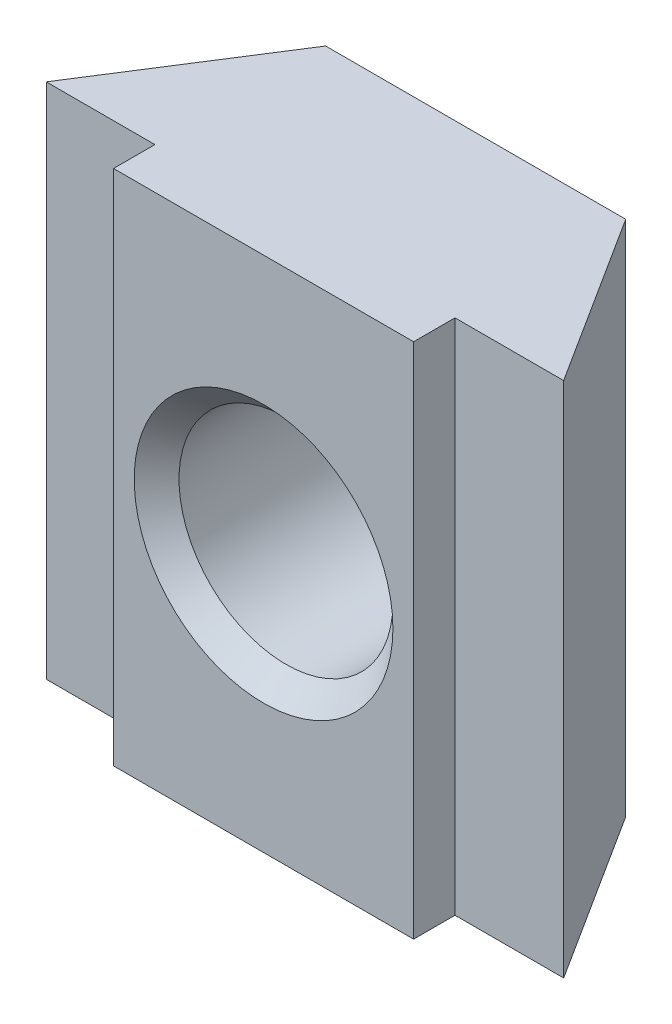
ISO-10303-21;
HEADER;
FILE_DESCRIPTION(('STEP AP214'),'2;1');
FILE_NAME('part.step','',(''),(''),'','','');
FILE_SCHEMA(('AUTOMOTIVE_DESIGN { 1 0 10303 214 1 1 1 1 }'));
ENDSEC;
DATA;
#1=APPLICATION_CONTEXT('core data for automotive mechanical design processes');
#2=APPLICATION_PROTOCOL_DEFINITION('international standard','automotive_design',2000,#1);
#3=PRODUCT_CONTEXT('',#1,'mechanical');
#4=PRODUCT('Part','Part','',(#3));
#5=PRODUCT_RELATED_PRODUCT_CATEGORY('part','',(#4));
#6=PRODUCT_DEFINITION_FORMATION('','',#4);
#7=PRODUCT_DEFINITION_CONTEXT('part definition',#1,'design');
#8=PRODUCT_DEFINITION('design','',#6,#7);
#9=PRODUCT_DEFINITION_SHAPE('','',#8);
#10=(LENGTH_UNIT() NAMED_UNIT(*) SI_UNIT(.MILLI.,.METRE.));
#11=(NAMED_UNIT(*) PLANE_ANGLE_UNIT() SI_UNIT($,.RADIAN.));
#12=(NAMED_UNIT(*) SI_UNIT($,.STERADIAN.) SOLID_ANGLE_UNIT());
#13=UNCERTAINTY_MEASURE_WITH_UNIT(LENGTH_MEASURE(1.E-05),#10,'distance_accuracy_value','');
#14=(GEOMETRIC_REPRESENTATION_CONTEXT(3) GLOBAL_UNCERTAINTY_ASSIGNED_CONTEXT((#13)) GLOBAL_UNIT_ASSIGNED_CONTEXT((#10,
#11,#12)) REPRESENTATION_CONTEXT('',''));
#15=CARTESIAN_POINT('',(0.,0.,0.));
#16=DIRECTION('',(0.,0.,1.));
#17=DIRECTION('',(1.,0.,0.));
#18=AXIS2_PLACEMENT_3D('',#15,#16,#17);
#19=CARTESIAN_POINT('',(13.,21.5,-9.30000000010978));
#20=DIRECTION('',(0.,0.,1.));
#21=DIRECTION('',(1.,0.,0.));
#22=AXIS2_PLACEMENT_3D('',#19,#20,#21);
#23=CONICAL_SURFACE('',#22,2.49999999990723,0.785398163397448);
#24=CARTESIAN_POINT('',(13.,21.5,-9.29999999999609));
#25=DIRECTION('',(0.,0.,1.));
#26=DIRECTION('',(1.,0.,0.));
#27=AXIS2_PLACEMENT_3D('',#24,#25,#26);
#28=CIRCLE('',#27,2.50000000002092);
#29=CARTESIAN_POINT('',(15.5000000000209,21.5,-9.29999999999609));
#30=VERTEX_POINT('',#29);
#31=EDGE_CURVE('E20',#30,#30,#28,.F.);
#32=ORIENTED_EDGE('',*,*,#31,.F.);
#33=EDGE_LOOP('',(#32));
#34=FACE_BOUND('',#33,.T.);
#35=CARTESIAN_POINT('',(13.,21.5,-9.733));
#36=DIRECTION('',(0.,0.,1.));
#37=DIRECTION('',(1.,0.,0.));
#38=AXIS2_PLACEMENT_3D('',#35,#36,#37);
#39=CIRCLE('',#38,2.067);
#40=CARTESIAN_POINT('',(15.067,21.5,-9.733));
#41=VERTEX_POINT('',#40);
#42=EDGE_CURVE('E122',#41,#41,#39,.F.);
#43=ORIENTED_EDGE('',*,*,#42,.T.);
#44=EDGE_LOOP('',(#43));
#45=FACE_BOUND('',#44,.T.);
#46=ADVANCED_FACE('F17',(#34,#45),#23,.F.);
#47=CARTESIAN_POINT('',(10.1,16.5,-9.3));
#48=DIRECTION('',(-1.,0.,0.));
#49=DIRECTION('',(0.,0.,1.));
#50=AXIS2_PLACEMENT_3D('',#47,#48,#49);
#51=PLANE('',#50);
#52=DIRECTION('',(0.,0.,1.));
#53=VECTOR('',#52,1.);
#54=CARTESIAN_POINT('',(10.1,16.5,-9.3));
#55=LINE('',#54,#53);
#56=CARTESIAN_POINT('',(10.1,16.5,-10.1));
#57=VERTEX_POINT('',#56);
#58=CARTESIAN_POINT('',(10.1,16.5,-9.3));
#59=VERTEX_POINT('',#58);
#60=EDGE_CURVE('E125',#57,#59,#55,.T.);
#61=ORIENTED_EDGE('',*,*,#60,.T.);
#62=DIRECTION('',(0.,1.,0.));
#63=VECTOR('',#62,1.);
#64=CARTESIAN_POINT('',(10.1,16.5,-9.3));
#65=LINE('',#64,#63);
#66=CARTESIAN_POINT('',(10.1,26.5,-9.3));
#67=VERTEX_POINT('',#66);
#68=EDGE_CURVE('E104',#67,#59,#65,.F.);
#69=ORIENTED_EDGE('',*,*,#68,.F.);
#70=DIRECTION('',(0.,0.,1.));
#71=VECTOR('',#70,1.);
#72=CARTESIAN_POINT('',(10.1,26.5,-9.3));
#73=LINE('',#72,#71);
#74=CARTESIAN_POINT('',(10.1,26.5,-10.1));
#75=VERTEX_POINT('',#74);
#76=EDGE_CURVE('E79',#67,#75,#73,.F.);
#77=ORIENTED_EDGE('',*,*,#76,.T.);
#78=DIRECTION('',(0.,1.,0.));
#79=VECTOR('',#78,1.);
#80=CARTESIAN_POINT('',(10.1,16.5,-10.1));
#81=LINE('',#80,#79);
#82=EDGE_CURVE('E103',#57,#75,#81,.T.);
#83=ORIENTED_EDGE('',*,*,#82,.F.);
#84=EDGE_LOOP('',(#61,#69,#77,#83));
#85=FACE_BOUND('',#84,.T.);
#86=ADVANCED_FACE('F263',(#85),#51,.T.);
#87=CARTESIAN_POINT('',(13.,21.5,-11.35));
#88=DIRECTION('',(0.,0.,1.));
#89=DIRECTION('',(1.,0.,0.));
#90=AXIS2_PLACEMENT_3D('',#87,#88,#89);
#91=CYLINDRICAL_SURFACE('',#90,2.067);
#92=CARTESIAN_POINT('',(13.,21.5,-12.9670000000601));
#93=DIRECTION('',(0.,0.,-1.));
#94=DIRECTION('',(-1.,0.,0.));
#95=AXIS2_PLACEMENT_3D('',#92,#93,#94);
#96=CIRCLE('',#95,2.06700000003411);
#97=CARTESIAN_POINT('',(10.9329999999659,21.5,-12.9670000000601));
#98=VERTEX_POINT('',#97);
#99=EDGE_CURVE('E116',#98,#98,#96,.T.);
#100=ORIENTED_EDGE('',*,*,#99,.T.);
#101=EDGE_LOOP('',(#100));
#102=FACE_BOUND('',#101,.T.);
#103=ORIENTED_EDGE('',*,*,#42,.F.);
#104=EDGE_LOOP('',(#103));
#105=FACE_BOUND('',#104,.T.);
#106=ADVANCED_FACE('F254',(#102,#105),#91,.F.);
#107=CARTESIAN_POINT('',(15.9,16.5,-10.1));
#108=DIRECTION('',(1.,0.,0.));
#109=DIRECTION('',(0.,0.,-1.));
#110=AXIS2_PLACEMENT_3D('',#107,#108,#109);
#111=PLANE('',#110);
#112=DIRECTION('',(0.,0.,-1.));
#113=VECTOR('',#112,1.);
#114=CARTESIAN_POINT('',(15.9,16.5,-10.1));
#115=LINE('',#114,#113);
#116=CARTESIAN_POINT('',(15.9,16.5,-9.3));
#117=VERTEX_POINT('',#116);
#118=CARTESIAN_POINT('',(15.9,16.5,-10.1));
#119=VERTEX_POINT('',#118);
#120=EDGE_CURVE('E120',#117,#119,#115,.T.);
#121=ORIENTED_EDGE('',*,*,#120,.T.);
#122=DIRECTION('',(0.,1.,0.));
#123=VECTOR('',#122,1.);
#124=CARTESIAN_POINT('',(15.9,16.5,-10.1));
#125=LINE('',#124,#123);
#126=CARTESIAN_POINT('',(15.9,26.5,-10.1));
#127=VERTEX_POINT('',#126);
#128=EDGE_CURVE('E91',#127,#119,#125,.F.);
#129=ORIENTED_EDGE('',*,*,#128,.F.);
#130=DIRECTION('',(0.,0.,-1.));
#131=VECTOR('',#130,1.);
#132=CARTESIAN_POINT('',(15.9,26.5,-9.3));
#133=LINE('',#132,#131);
#134=CARTESIAN_POINT('',(15.9,26.5,-9.3));
#135=VERTEX_POINT('',#134);
#136=EDGE_CURVE('E85',#127,#135,#133,.F.);
#137=ORIENTED_EDGE('',*,*,#136,.T.);
#138=DIRECTION('',(0.,1.,0.));
#139=VECTOR('',#138,1.);
#140=CARTESIAN_POINT('',(15.9,16.5,-9.3));
#141=LINE('',#140,#139);
#142=EDGE_CURVE('E88',#117,#135,#141,.T.);
#143=ORIENTED_EDGE('',*,*,#142,.F.);
#144=EDGE_LOOP('',(#121,#129,#137,#143));
#145=FACE_BOUND('',#144,.T.);
#146=ADVANCED_FACE('F87',(#145),#111,.T.);
#147=CARTESIAN_POINT('',(15.9,16.5,-9.3));
#148=DIRECTION('',(0.,0.,1.));
#149=DIRECTION('',(1.,0.,0.));
#150=AXIS2_PLACEMENT_3D('',#147,#148,#149);
#151=PLANE('',#150);
#152=DIRECTION('',(1.,0.,0.));
#153=VECTOR('',#152,1.);
#154=CARTESIAN_POINT('',(13.,16.5,-9.3));
#155=LINE('',#154,#153);
#156=EDGE_CURVE('E102',#117,#59,#155,.F.);
#157=ORIENTED_EDGE('',*,*,#156,.F.);
#158=ORIENTED_EDGE('',*,*,#142,.T.);
#159=DIRECTION('',(1.,0.,0.));
#160=VECTOR('',#159,1.);
#161=CARTESIAN_POINT('',(13.,26.5,-9.3));
#162=LINE('',#161,#160);
#163=EDGE_CURVE('E93',#135,#67,#162,.F.);
#164=ORIENTED_EDGE('',*,*,#163,.T.);
#165=ORIENTED_EDGE('',*,*,#68,.T.);
#166=EDGE_LOOP('',(#157,#158,#164,#165));
#167=FACE_BOUND('',#166,.T.);
#168=ORIENTED_EDGE('',*,*,#31,.T.);
#169=EDGE_LOOP('',(#168));
#170=FACE_BOUND('',#169,.T.);
#171=ADVANCED_FACE('F98',(#167,#170),#151,.T.);
#172=CARTESIAN_POINT('',(10.1,16.5,-10.1));
#173=DIRECTION('',(0.,0.,1.));
#174=DIRECTION('',(1.,0.,0.));
#175=AXIS2_PLACEMENT_3D('',#172,#173,#174);
#176=PLANE('',#175);
#177=DIRECTION('',(1.,0.,0.));
#178=VECTOR('',#177,1.);
#179=CARTESIAN_POINT('',(13.,16.5,-10.1));
#180=LINE('',#179,#178);
#181=CARTESIAN_POINT('',(8.,16.5,-10.1));
#182=VERTEX_POINT('',#181);
#183=EDGE_CURVE('E137',#57,#182,#180,.F.);
#184=ORIENTED_EDGE('',*,*,#183,.F.);
#185=ORIENTED_EDGE('',*,*,#82,.T.);
#186=DIRECTION('',(1.,0.,0.));
#187=VECTOR('',#186,1.);
#188=CARTESIAN_POINT('',(13.,26.5,-10.1));
#189=LINE('',#188,#187);
#190=CARTESIAN_POINT('',(8.,26.5,-10.1));
#191=VERTEX_POINT('',#190);
#192=EDGE_CURVE('E108',#75,#191,#189,.F.);
#193=ORIENTED_EDGE('',*,*,#192,.T.);
#194=DIRECTION('',(0.,1.,0.));
#195=VECTOR('',#194,1.);
#196=CARTESIAN_POINT('',(8.,16.5,-10.1));
#197=LINE('',#196,#195);
#198=EDGE_CURVE('E94',#182,#191,#197,.T.);
#199=ORIENTED_EDGE('',*,*,#198,.F.);
#200=EDGE_LOOP('',(#184,#185,#193,#199));
#201=FACE_BOUND('',#200,.T.);
#202=ADVANCED_FACE('F227',(#201),#176,.T.);
#203=CARTESIAN_POINT('',(13.,21.5,-13.3999999999332));
#204=DIRECTION('',(0.,0.,-1.));
#205=DIRECTION('',(-1.,0.,0.));
#206=AXIS2_PLACEMENT_3D('',#203,#204,#205);
#207=CONICAL_SURFACE('',#206,2.49999999990723,0.785398163397448);
#208=CARTESIAN_POINT('',(13.,21.5,-13.3999999999901));
#209=DIRECTION('',(0.,0.,-1.));
#210=DIRECTION('',(-1.,0.,0.));
#211=AXIS2_PLACEMENT_3D('',#208,#209,#210);
#212=CIRCLE('',#211,2.49999999996408);
#213=CARTESIAN_POINT('',(10.5000000000359,21.5,-13.3999999999901));
#214=VERTEX_POINT('',#213);
#215=EDGE_CURVE('E129',#214,#214,#212,.F.);
#216=ORIENTED_EDGE('',*,*,#215,.F.);
#217=EDGE_LOOP('',(#216));
#218=FACE_BOUND('',#217,.T.);
#219=ORIENTED_EDGE('',*,*,#99,.F.);
#220=EDGE_LOOP('',(#219));
#221=FACE_BOUND('',#220,.T.);
#222=ADVANCED_FACE('F218',(#218,#221),#207,.F.);
#223=CARTESIAN_POINT('',(8.,16.5,-10.1));
#224=DIRECTION('',(-0.843661487732107,0.,-0.536875492193159));
#225=DIRECTION('',(-0.536875492193159,0.,0.843661487732107));
#226=AXIS2_PLACEMENT_3D('',#223,#224,#225);
#227=PLANE('',#226);
#228=DIRECTION('',(0.536875492193159,0.,-0.843661487732108));
#229=VECTOR('',#228,1.);
#230=CARTESIAN_POINT('',(8.,16.5,-10.1));
#231=LINE('',#230,#229);
#232=CARTESIAN_POINT('',(10.1,16.5,-13.4));
#233=VERTEX_POINT('',#232);
#234=EDGE_CURVE('E132',#182,#233,#231,.T.);
#235=ORIENTED_EDGE('',*,*,#234,.F.);
#236=ORIENTED_EDGE('',*,*,#198,.T.);
#237=DIRECTION('',(0.536875492193159,0.,-0.843661487732108));
#238=VECTOR('',#237,1.);
#239=CARTESIAN_POINT('',(8.,26.5,-10.1));
#240=LINE('',#239,#238);
#241=CARTESIAN_POINT('',(10.1,26.5,-13.4));
#242=VERTEX_POINT('',#241);
#243=EDGE_CURVE('E110',#191,#242,#240,.T.);
#244=ORIENTED_EDGE('',*,*,#243,.T.);
#245=DIRECTION('',(0.,1.,0.));
#246=VECTOR('',#245,1.);
#247=CARTESIAN_POINT('',(10.1,16.5,-13.4));
#248=LINE('',#247,#246);
#249=EDGE_CURVE('E155',#233,#242,#248,.T.);
#250=ORIENTED_EDGE('',*,*,#249,.F.);
#251=EDGE_LOOP('',(#235,#236,#244,#250));
#252=FACE_BOUND('',#251,.T.);
#253=ADVANCED_FACE('F153',(#252),#227,.T.);
#254=CARTESIAN_POINT('',(13.,26.5,-9.3));
#255=DIRECTION('',(0.,-1.,0.));
#256=DIRECTION('',(0.,0.,-1.));
#257=AXIS2_PLACEMENT_3D('',#254,#255,#256);
#258=PLANE('',#257);
#259=DIRECTION('',(-1.,0.,0.));
#260=VECTOR('',#259,1.);
#261=CARTESIAN_POINT('',(10.1,26.5,-13.4));
#262=LINE('',#261,#260);
#263=CARTESIAN_POINT('',(15.9,26.5,-13.4));
#264=VERTEX_POINT('',#263);
#265=EDGE_CURVE('E131',#242,#264,#262,.F.);
#266=ORIENTED_EDGE('',*,*,#265,.F.);
#267=ORIENTED_EDGE('',*,*,#243,.F.);
#268=ORIENTED_EDGE('',*,*,#192,.F.);
#269=ORIENTED_EDGE('',*,*,#76,.F.);
#270=ORIENTED_EDGE('',*,*,#163,.F.);
#271=ORIENTED_EDGE('',*,*,#136,.F.);
#272=DIRECTION('',(1.,0.,0.));
#273=VECTOR('',#272,1.);
#274=CARTESIAN_POINT('',(18.,26.5,-10.1));
#275=LINE('',#274,#273);
#276=CARTESIAN_POINT('',(18.,26.5,-10.1));
#277=VERTEX_POINT('',#276);
#278=EDGE_CURVE('E150',#277,#127,#275,.F.);
#279=ORIENTED_EDGE('',*,*,#278,.F.);
#280=DIRECTION('',(-0.536875492193159,0.,-0.843661487732107));
#281=VECTOR('',#280,1.);
#282=CARTESIAN_POINT('',(15.9,26.5,-13.4));
#283=LINE('',#282,#281);
#284=EDGE_CURVE('E157',#264,#277,#283,.F.);
#285=ORIENTED_EDGE('',*,*,#284,.F.);
#286=EDGE_LOOP('',(#266,#267,#268,#269,#270,#271,#279,#285));
#287=FACE_BOUND('',#286,.T.);
#288=ADVANCED_FACE('F107',(#287),#258,.F.);
#289=CARTESIAN_POINT('',(18.,16.5,-10.1));
#290=DIRECTION('',(0.,0.,1.));
#291=DIRECTION('',(1.,0.,0.));
#292=AXIS2_PLACEMENT_3D('',#289,#290,#291);
#293=PLANE('',#292);
#294=DIRECTION('',(1.,0.,0.));
#295=VECTOR('',#294,1.);
#296=CARTESIAN_POINT('',(13.,16.5,-10.1));
#297=LINE('',#296,#295);
#298=CARTESIAN_POINT('',(18.,16.5,-10.1));
#299=VERTEX_POINT('',#298);
#300=EDGE_CURVE('E146',#299,#119,#297,.F.);
#301=ORIENTED_EDGE('',*,*,#300,.F.);
#302=DIRECTION('',(0.,1.,0.));
#303=VECTOR('',#302,1.);
#304=CARTESIAN_POINT('',(18.,16.5,-10.1));
#305=LINE('',#304,#303);
#306=EDGE_CURVE('E161',#277,#299,#305,.F.);
#307=ORIENTED_EDGE('',*,*,#306,.F.);
#308=ORIENTED_EDGE('',*,*,#278,.T.);
#309=ORIENTED_EDGE('',*,*,#128,.T.);
#310=EDGE_LOOP('',(#301,#307,#308,#309));
#311=FACE_BOUND('',#310,.T.);
#312=ADVANCED_FACE('F172',(#311),#293,.T.);
#313=CARTESIAN_POINT('',(13.,16.5,-9.3));
#314=DIRECTION('',(0.,-1.,0.));
#315=DIRECTION('',(0.,0.,-1.));
#316=AXIS2_PLACEMENT_3D('',#313,#314,#315);
#317=PLANE('',#316);
#318=ORIENTED_EDGE('',*,*,#183,.T.);
#319=ORIENTED_EDGE('',*,*,#234,.T.);
#320=DIRECTION('',(-1.,0.,0.));
#321=VECTOR('',#320,1.);
#322=CARTESIAN_POINT('',(10.1,16.5,-13.4));
#323=LINE('',#322,#321);
#324=CARTESIAN_POINT('',(15.9,16.5,-13.4));
#325=VERTEX_POINT('',#324);
#326=EDGE_CURVE('E35',#325,#233,#323,.T.);
#327=ORIENTED_EDGE('',*,*,#326,.F.);
#328=DIRECTION('',(-0.536875492193159,0.,-0.843661487732107));
#329=VECTOR('',#328,1.);
#330=CARTESIAN_POINT('',(15.9,16.5,-13.4));
#331=LINE('',#330,#329);
#332=EDGE_CURVE('E26',#299,#325,#331,.T.);
#333=ORIENTED_EDGE('',*,*,#332,.F.);
#334=ORIENTED_EDGE('',*,*,#300,.T.);
#335=ORIENTED_EDGE('',*,*,#120,.F.);
#336=ORIENTED_EDGE('',*,*,#156,.T.);
#337=ORIENTED_EDGE('',*,*,#60,.F.);
#338=EDGE_LOOP('',(#318,#319,#327,#333,#334,#335,#336,#337));
#339=FACE_BOUND('',#338,.T.);
#340=ADVANCED_FACE('F170',(#339),#317,.T.);
#341=CARTESIAN_POINT('',(10.1,16.5,-13.4));
#342=DIRECTION('',(0.,0.,-1.));
#343=DIRECTION('',(-1.,0.,0.));
#344=AXIS2_PLACEMENT_3D('',#341,#342,#343);
#345=PLANE('',#344);
#346=ORIENTED_EDGE('',*,*,#326,.T.);
#347=ORIENTED_EDGE('',*,*,#249,.T.);
#348=ORIENTED_EDGE('',*,*,#265,.T.);
#349=DIRECTION('',(0.,1.,0.));
#350=VECTOR('',#349,1.);
#351=CARTESIAN_POINT('',(15.9,16.5,-13.4));
#352=LINE('',#351,#350);
#353=EDGE_CURVE('E11',#325,#264,#352,.T.);
#354=ORIENTED_EDGE('',*,*,#353,.F.);
#355=EDGE_LOOP('',(#346,#347,#348,#354));
#356=FACE_BOUND('',#355,.T.);
#357=ORIENTED_EDGE('',*,*,#215,.T.);
#358=EDGE_LOOP('',(#357));
#359=FACE_BOUND('',#358,.T.);
#360=ADVANCED_FACE('F159',(#356,#359),#345,.T.);
#361=CARTESIAN_POINT('',(15.9,16.5,-13.4));
#362=DIRECTION('',(0.843661487732107,0.,-0.536875492193159));
#363=DIRECTION('',(-0.536875492193159,0.,-0.843661487732107));
#364=AXIS2_PLACEMENT_3D('',#361,#362,#363);
#365=PLANE('',#364);
#366=ORIENTED_EDGE('',*,*,#332,.T.);
#367=ORIENTED_EDGE('',*,*,#353,.T.);
#368=ORIENTED_EDGE('',*,*,#284,.T.);
#369=ORIENTED_EDGE('',*,*,#306,.T.);
#370=EDGE_LOOP('',(#366,#367,#368,#369));
#371=FACE_BOUND('',#370,.T.);
#372=ADVANCED_FACE('F168',(#371),#365,.T.);
#373=CLOSED_SHELL('',(#46,#86,#106,#146,#171,#202,#222,#253,#288,#312,#340,#360,#372));
#374=MANIFOLD_SOLID_BREP('B1',#373);
#375=ADVANCED_BREP_SHAPE_REPRESENTATION('',(#18,#374),#14);
#376=SHAPE_DEFINITION_REPRESENTATION(#9,#375);
ENDSEC;
END-ISO-10303-21;
